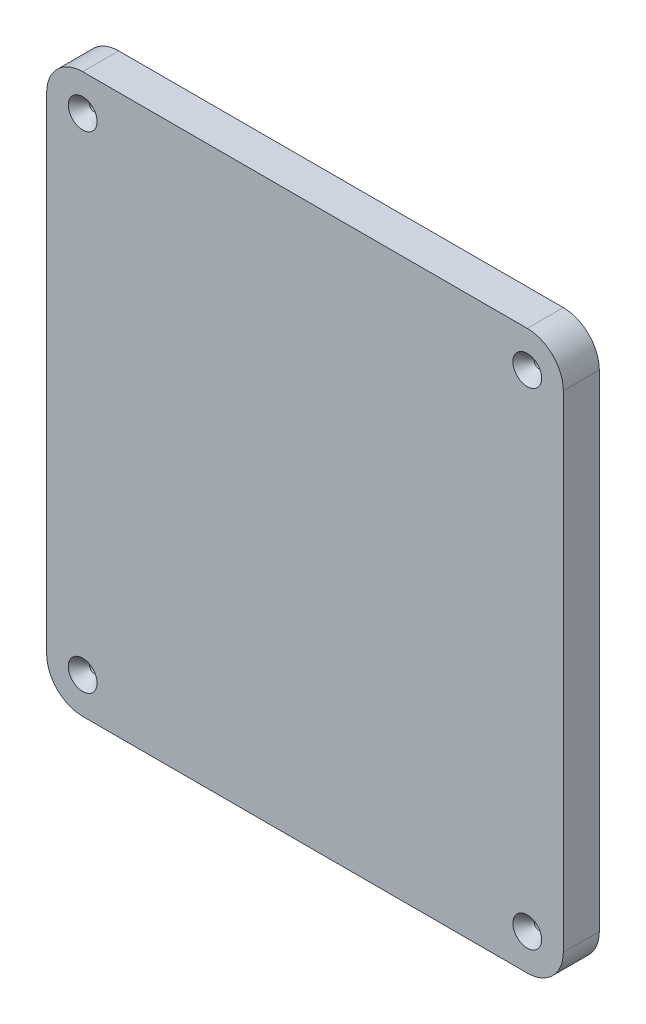
ISO-10303-21;
HEADER;
FILE_DESCRIPTION(('STEP AP214'),'2;1');
FILE_NAME('part.step','',(''),(''),'','','');
FILE_SCHEMA(('AUTOMOTIVE_DESIGN { 1 0 10303 214 1 1 1 1 }'));
ENDSEC;
DATA;
#1=APPLICATION_CONTEXT('core data for automotive mechanical design processes');
#2=APPLICATION_PROTOCOL_DEFINITION('international standard','automotive_design',2000,#1);
#3=PRODUCT_CONTEXT('',#1,'mechanical');
#4=PRODUCT('Part','Part','',(#3));
#5=PRODUCT_RELATED_PRODUCT_CATEGORY('part','',(#4));
#6=PRODUCT_DEFINITION_FORMATION('','',#4);
#7=PRODUCT_DEFINITION_CONTEXT('part definition',#1,'design');
#8=PRODUCT_DEFINITION('design','',#6,#7);
#9=PRODUCT_DEFINITION_SHAPE('','',#8);
#10=(LENGTH_UNIT() NAMED_UNIT(*) SI_UNIT(.MILLI.,.METRE.));
#11=(NAMED_UNIT(*) PLANE_ANGLE_UNIT() SI_UNIT($,.RADIAN.));
#12=(NAMED_UNIT(*) SI_UNIT($,.STERADIAN.) SOLID_ANGLE_UNIT());
#13=UNCERTAINTY_MEASURE_WITH_UNIT(LENGTH_MEASURE(1.E-05),#10,'distance_accuracy_value','');
#14=(GEOMETRIC_REPRESENTATION_CONTEXT(3) GLOBAL_UNCERTAINTY_ASSIGNED_CONTEXT((#13)) GLOBAL_UNIT_ASSIGNED_CONTEXT((#10,
#11,#12)) REPRESENTATION_CONTEXT('',''));
#15=CARTESIAN_POINT('',(0.,0.,0.));
#16=DIRECTION('',(0.,0.,1.));
#17=DIRECTION('',(1.,0.,0.));
#18=AXIS2_PLACEMENT_3D('',#15,#16,#17);
#19=CARTESIAN_POINT('',(-43.0999999939929,668.077163009694,12.7000000000008));
#20=DIRECTION('',(0.,0.999999999999997,0.));
#21=DIRECTION('',(-1.,0.,0.));
#22=AXIS2_PLACEMENT_3D('',#19,#20,#21);
#23=PLANE('',#22);
#24=DIRECTION('',(1.,0.,0.));
#25=VECTOR('',#24,1.);
#26=CARTESIAN_POINT('',(-43.0999999939928,668.077163009697,6.66133814775094E-13));
#27=LINE('',#26,#25);
#28=CARTESIAN_POINT('',(-30.399999993993,668.077163009697,6.66133814775094E-13));
#29=VERTEX_POINT('',#28);
#30=CARTESIAN_POINT('',(126.350000000009,668.077163009695,1.33226762955019E-12));
#31=VERTEX_POINT('',#30);
#32=EDGE_CURVE('E138',#29,#31,#27,.T.);
#33=ORIENTED_EDGE('',*,*,#32,.T.);
#34=DIRECTION('',(0.,0.,-0.999999999999997));
#35=VECTOR('',#34,1.);
#36=CARTESIAN_POINT('',(126.350000000009,668.077163009695,12.7000000000015));
#37=LINE('',#36,#35);
#38=CARTESIAN_POINT('',(126.350000000009,668.077163009695,12.7000000000015));
#39=VERTEX_POINT('',#38);
#40=EDGE_CURVE('E161',#31,#39,#37,.F.);
#41=ORIENTED_EDGE('',*,*,#40,.T.);
#42=DIRECTION('',(1.,0.,0.));
#43=VECTOR('',#42,1.);
#44=CARTESIAN_POINT('',(-43.0999999939929,668.077163009694,12.7000000000008));
#45=LINE('',#44,#43);
#46=CARTESIAN_POINT('',(-30.3999999939932,668.077163009697,12.7000000000008));
#47=VERTEX_POINT('',#46);
#48=EDGE_CURVE('E136',#47,#39,#45,.T.);
#49=ORIENTED_EDGE('',*,*,#48,.F.);
#50=DIRECTION('',(0.,0.,-0.999999999999997));
#51=VECTOR('',#50,1.);
#52=CARTESIAN_POINT('',(-30.3999999939932,668.077163009697,12.7000000000008));
#53=LINE('',#52,#51);
#54=EDGE_CURVE('E158',#47,#29,#53,.T.);
#55=ORIENTED_EDGE('',*,*,#54,.T.);
#56=EDGE_LOOP('',(#33,#41,#49,#55));
#57=FACE_BOUND('',#56,.T.);
#58=ADVANCED_FACE('F41',(#57),#23,.F.);
#59=CARTESIAN_POINT('',(139.050000000009,668.077163009695,12.7000000000015));
#60=DIRECTION('',(-1.,0.,0.));
#61=DIRECTION('',(0.,-0.999999999999997,0.));
#62=AXIS2_PLACEMENT_3D('',#59,#60,#61);
#63=PLANE('',#62);
#64=DIRECTION('',(0.,0.999999999999997,0.));
#65=VECTOR('',#64,1.);
#66=CARTESIAN_POINT('',(139.050000000009,668.077163009695,1.55431223447522E-12));
#67=LINE('',#66,#65);
#68=CARTESIAN_POINT('',(139.050000000009,680.777163009695,1.33226762955019E-12));
#69=VERTEX_POINT('',#68);
#70=CARTESIAN_POINT('',(139.050000000008,852.227163009694,6.66133814775094E-13));
#71=VERTEX_POINT('',#70);
#72=EDGE_CURVE('E134',#69,#71,#67,.T.);
#73=ORIENTED_EDGE('',*,*,#72,.T.);
#74=DIRECTION('',(0.,0.,-0.999999999999997));
#75=VECTOR('',#74,1.);
#76=CARTESIAN_POINT('',(139.050000000009,852.227163009694,12.7000000000004));
#77=LINE('',#76,#75);
#78=CARTESIAN_POINT('',(139.050000000009,852.227163009694,12.7000000000004));
#79=VERTEX_POINT('',#78);
#80=EDGE_CURVE('E113',#71,#79,#77,.F.);
#81=ORIENTED_EDGE('',*,*,#80,.T.);
#82=DIRECTION('',(0.,0.999999999999997,0.));
#83=VECTOR('',#82,1.);
#84=CARTESIAN_POINT('',(139.050000000009,668.077163009695,12.7000000000015));
#85=LINE('',#84,#83);
#86=CARTESIAN_POINT('',(139.050000000009,680.777163009694,12.7000000000017));
#87=VERTEX_POINT('',#86);
#88=EDGE_CURVE('E198',#87,#79,#85,.T.);
#89=ORIENTED_EDGE('',*,*,#88,.F.);
#90=DIRECTION('',(0.,0.,-0.999999999999997));
#91=VECTOR('',#90,1.);
#92=CARTESIAN_POINT('',(139.050000000009,680.777163009694,12.7000000000017));
#93=LINE('',#92,#91);
#94=EDGE_CURVE('E118',#87,#69,#93,.T.);
#95=ORIENTED_EDGE('',*,*,#94,.T.);
#96=EDGE_LOOP('',(#73,#81,#89,#95));
#97=FACE_BOUND('',#96,.T.);
#98=ADVANCED_FACE('F215',(#97),#63,.F.);
#99=CARTESIAN_POINT('',(139.050000000009,864.927163009692,12.7000000000015));
#100=DIRECTION('',(0.,-0.999999999999997,0.));
#101=DIRECTION('',(1.,0.,0.));
#102=AXIS2_PLACEMENT_3D('',#99,#100,#101);
#103=PLANE('',#102);
#104=DIRECTION('',(-1.,0.,0.));
#105=VECTOR('',#104,1.);
#106=CARTESIAN_POINT('',(139.050000000009,864.927163009692,12.7000000000015));
#107=LINE('',#106,#105);
#108=CARTESIAN_POINT('',(126.350000000009,864.927163009694,12.7000000000013));
#109=VERTEX_POINT('',#108);
#110=CARTESIAN_POINT('',(-30.3999999939929,864.927163009694,12.700000000002));
#111=VERTEX_POINT('',#110);
#112=EDGE_CURVE('E127',#109,#111,#107,.T.);
#113=ORIENTED_EDGE('',*,*,#112,.F.);
#114=DIRECTION('',(0.,0.,-0.999999999999997));
#115=VECTOR('',#114,1.);
#116=CARTESIAN_POINT('',(126.350000000009,864.927163009694,12.7000000000013));
#117=LINE('',#116,#115);
#118=CARTESIAN_POINT('',(126.350000000009,864.927163009693,1.88737914186277E-12));
#119=VERTEX_POINT('',#118);
#120=EDGE_CURVE('E112',#109,#119,#117,.T.);
#121=ORIENTED_EDGE('',*,*,#120,.T.);
#122=DIRECTION('',(-1.,0.,0.));
#123=VECTOR('',#122,1.);
#124=CARTESIAN_POINT('',(139.050000000009,864.927163009694,8.88178419700125E-13));
#125=LINE('',#124,#123);
#126=CARTESIAN_POINT('',(-30.3999999939926,864.927163009693,2.22044604925031E-12));
#127=VERTEX_POINT('',#126);
#128=EDGE_CURVE('E125',#119,#127,#125,.T.);
#129=ORIENTED_EDGE('',*,*,#128,.T.);
#130=DIRECTION('',(0.,0.,-0.999999999999997));
#131=VECTOR('',#130,1.);
#132=CARTESIAN_POINT('',(-30.3999999939929,864.927163009694,12.700000000002));
#133=LINE('',#132,#131);
#134=EDGE_CURVE('E129',#127,#111,#133,.F.);
#135=ORIENTED_EDGE('',*,*,#134,.T.);
#136=EDGE_LOOP('',(#113,#121,#129,#135));
#137=FACE_BOUND('',#136,.T.);
#138=ADVANCED_FACE('F124',(#137),#103,.F.);
#139=CARTESIAN_POINT('',(-43.099999993993,864.927163009693,12.7000000000016));
#140=DIRECTION('',(1.,0.,0.));
#141=DIRECTION('',(0.,0.999999999999997,0.));
#142=AXIS2_PLACEMENT_3D('',#139,#140,#141);
#143=PLANE('',#142);
#144=DIRECTION('',(0.,-0.999999999999997,0.));
#145=VECTOR('',#144,1.);
#146=CARTESIAN_POINT('',(-43.0999999939928,864.927163009694,1.55431223447522E-12));
#147=LINE('',#146,#145);
#148=CARTESIAN_POINT('',(-43.099999993993,852.227163009693,6.66133814775094E-13));
#149=VERTEX_POINT('',#148);
#150=CARTESIAN_POINT('',(-43.0999999939931,680.777163009694,7.7715611723761E-13));
#151=VERTEX_POINT('',#150);
#152=EDGE_CURVE('E133',#149,#151,#147,.T.);
#153=ORIENTED_EDGE('',*,*,#152,.T.);
#154=DIRECTION('',(0.,0.,-0.999999999999997));
#155=VECTOR('',#154,1.);
#156=CARTESIAN_POINT('',(-43.099999993993,680.777163009696,12.7000000000002));
#157=LINE('',#156,#155);
#158=CARTESIAN_POINT('',(-43.099999993993,680.777163009696,12.7000000000002));
#159=VERTEX_POINT('',#158);
#160=EDGE_CURVE('E11',#151,#159,#157,.F.);
#161=ORIENTED_EDGE('',*,*,#160,.T.);
#162=DIRECTION('',(0.,-0.999999999999997,0.));
#163=VECTOR('',#162,1.);
#164=CARTESIAN_POINT('',(-43.099999993993,864.927163009693,12.7000000000016));
#165=LINE('',#164,#163);
#166=CARTESIAN_POINT('',(-43.099999993993,852.227163009695,12.700000000001));
#167=VERTEX_POINT('',#166);
#168=EDGE_CURVE('E142',#167,#159,#165,.T.);
#169=ORIENTED_EDGE('',*,*,#168,.F.);
#170=DIRECTION('',(0.,0.,-0.999999999999997));
#171=VECTOR('',#170,1.);
#172=CARTESIAN_POINT('',(-43.099999993993,852.227163009695,12.700000000001));
#173=LINE('',#172,#171);
#174=EDGE_CURVE('E50',#167,#149,#173,.T.);
#175=ORIENTED_EDGE('',*,*,#174,.T.);
#176=EDGE_LOOP('',(#153,#161,#169,#175));
#177=FACE_BOUND('',#176,.T.);
#178=ADVANCED_FACE('F222',(#177),#143,.F.);
#179=CARTESIAN_POINT('',(1.31838984174237E-13,0.,12.7000000000018));
#180=DIRECTION('',(0.,0.,0.999999999999997));
#181=DIRECTION('',(1.,0.,0.));
#182=AXIS2_PLACEMENT_3D('',#179,#180,#181);
#183=PLANE('',#182);
#184=CARTESIAN_POINT('',(-30.3999999939931,852.227163009694,12.7000000000019));
#185=DIRECTION('',(0.,0.,0.999999999999997));
#186=DIRECTION('',(1.,0.,0.));
#187=AXIS2_PLACEMENT_3D('',#184,#185,#186);
#188=CIRCLE('',#187,5.08);
#189=CARTESIAN_POINT('',(-25.3199999939931,852.227163009694,12.7000000000019));
#190=VERTEX_POINT('',#189);
#191=EDGE_CURVE('E287',#190,#190,#188,.T.);
#192=ORIENTED_EDGE('',*,*,#191,.F.);
#193=EDGE_LOOP('',(#192));
#194=FACE_BOUND('',#193,.T.);
#195=CARTESIAN_POINT('',(-30.399999993993,680.777163009697,12.700000000001));
#196=DIRECTION('',(0.,0.,0.999999999999997));
#197=DIRECTION('',(1.,0.,0.));
#198=AXIS2_PLACEMENT_3D('',#195,#196,#197);
#199=CIRCLE('',#198,5.08);
#200=CARTESIAN_POINT('',(-25.319999993993,680.777163009697,12.700000000001));
#201=VERTEX_POINT('',#200);
#202=EDGE_CURVE('E182',#201,#201,#199,.T.);
#203=ORIENTED_EDGE('',*,*,#202,.F.);
#204=EDGE_LOOP('',(#203));
#205=FACE_BOUND('',#204,.T.);
#206=CARTESIAN_POINT('',(126.350000000009,680.777163009694,12.7000000000017));
#207=DIRECTION('',(0.,0.,0.999999999999997));
#208=DIRECTION('',(1.,0.,0.));
#209=AXIS2_PLACEMENT_3D('',#206,#207,#208);
#210=CIRCLE('',#209,5.08);
#211=CARTESIAN_POINT('',(131.430000000009,680.777163009694,12.7000000000017));
#212=VERTEX_POINT('',#211);
#213=EDGE_CURVE('E175',#212,#212,#210,.T.);
#214=ORIENTED_EDGE('',*,*,#213,.F.);
#215=EDGE_LOOP('',(#214));
#216=FACE_BOUND('',#215,.T.);
#217=CARTESIAN_POINT('',(126.350000000009,852.227163009692,12.7000000000017));
#218=DIRECTION('',(0.,0.,0.999999999999997));
#219=DIRECTION('',(1.,0.,0.));
#220=AXIS2_PLACEMENT_3D('',#217,#218,#219);
#221=CIRCLE('',#220,5.08);
#222=CARTESIAN_POINT('',(131.430000000009,852.227163009692,12.7000000000017));
#223=VERTEX_POINT('',#222);
#224=EDGE_CURVE('E171',#223,#223,#221,.T.);
#225=ORIENTED_EDGE('',*,*,#224,.F.);
#226=EDGE_LOOP('',(#225));
#227=FACE_BOUND('',#226,.T.);
#228=ORIENTED_EDGE('',*,*,#88,.T.);
#229=CARTESIAN_POINT('',(126.350000000009,852.227163009694,12.7000000000004));
#230=DIRECTION('',(0.,0.,0.999999999999997));
#231=DIRECTION('',(1.,0.,0.));
#232=AXIS2_PLACEMENT_3D('',#229,#230,#231);
#233=CIRCLE('',#232,12.7);
#234=EDGE_CURVE('E156',#79,#109,#233,.T.);
#235=ORIENTED_EDGE('',*,*,#234,.T.);
#236=ORIENTED_EDGE('',*,*,#112,.T.);
#237=CARTESIAN_POINT('',(-30.3999999939931,852.227163009694,12.7000000000019));
#238=DIRECTION('',(0.,0.,0.999999999999997));
#239=DIRECTION('',(1.,0.,0.));
#240=AXIS2_PLACEMENT_3D('',#237,#238,#239);
#241=CIRCLE('',#240,12.7);
#242=EDGE_CURVE('E63',#111,#167,#241,.T.);
#243=ORIENTED_EDGE('',*,*,#242,.T.);
#244=ORIENTED_EDGE('',*,*,#168,.T.);
#245=CARTESIAN_POINT('',(-30.399999993993,680.777163009695,12.7000000000017));
#246=DIRECTION('',(0.,0.,0.999999999999997));
#247=DIRECTION('',(1.,0.,0.));
#248=AXIS2_PLACEMENT_3D('',#245,#246,#247);
#249=CIRCLE('',#248,12.7);
#250=EDGE_CURVE('E152',#159,#47,#249,.T.);
#251=ORIENTED_EDGE('',*,*,#250,.T.);
#252=ORIENTED_EDGE('',*,*,#48,.T.);
#253=CARTESIAN_POINT('',(126.350000000009,680.777163009694,12.7000000000017));
#254=DIRECTION('',(0.,0.,0.999999999999997));
#255=DIRECTION('',(1.,0.,0.));
#256=AXIS2_PLACEMENT_3D('',#253,#254,#255);
#257=CIRCLE('',#256,12.7);
#258=EDGE_CURVE('E154',#39,#87,#257,.T.);
#259=ORIENTED_EDGE('',*,*,#258,.T.);
#260=EDGE_LOOP('',(#228,#235,#236,#243,#244,#251,#252,#259));
#261=FACE_BOUND('',#260,.T.);
#262=ADVANCED_FACE('F213',(#194,#205,#216,#227,#261),#183,.T.);
#263=CARTESIAN_POINT('',(0.,0.,0.));
#264=DIRECTION('',(0.,0.,0.999999999999997));
#265=DIRECTION('',(1.,0.,0.));
#266=AXIS2_PLACEMENT_3D('',#263,#264,#265);
#267=PLANE('',#266);
#268=CARTESIAN_POINT('',(-30.399999993993,852.227163009695,1.55431223447522E-12));
#269=DIRECTION('',(0.,0.,0.999999999999997));
#270=DIRECTION('',(1.,0.,0.));
#271=AXIS2_PLACEMENT_3D('',#268,#269,#270);
#272=CIRCLE('',#271,1.5875);
#273=CARTESIAN_POINT('',(-28.812499993993,852.227163009695,1.55431223447522E-12));
#274=VERTEX_POINT('',#273);
#275=EDGE_CURVE('E45',#274,#274,#272,.T.);
#276=ORIENTED_EDGE('',*,*,#275,.T.);
#277=EDGE_LOOP('',(#276));
#278=FACE_BOUND('',#277,.T.);
#279=CARTESIAN_POINT('',(-30.3999999939931,680.777163009696,1.33226762955019E-12));
#280=DIRECTION('',(0.,0.,0.999999999999997));
#281=DIRECTION('',(1.,0.,0.));
#282=AXIS2_PLACEMENT_3D('',#279,#280,#281);
#283=CIRCLE('',#282,1.5875);
#284=CARTESIAN_POINT('',(-28.8124999939931,680.777163009696,1.33226762955019E-12));
#285=VERTEX_POINT('',#284);
#286=EDGE_CURVE('E173',#285,#285,#283,.T.);
#287=ORIENTED_EDGE('',*,*,#286,.T.);
#288=EDGE_LOOP('',(#287));
#289=FACE_BOUND('',#288,.T.);
#290=CARTESIAN_POINT('',(126.350000000009,680.777163009695,1.33226762955019E-12));
#291=DIRECTION('',(0.,0.,0.999999999999997));
#292=DIRECTION('',(1.,0.,0.));
#293=AXIS2_PLACEMENT_3D('',#290,#291,#292);
#294=CIRCLE('',#293,1.58750000000001);
#295=CARTESIAN_POINT('',(127.937500000009,680.777163009695,1.33226762955019E-12));
#296=VERTEX_POINT('',#295);
#297=EDGE_CURVE('E169',#296,#296,#294,.T.);
#298=ORIENTED_EDGE('',*,*,#297,.T.);
#299=EDGE_LOOP('',(#298));
#300=FACE_BOUND('',#299,.T.);
#301=CARTESIAN_POINT('',(126.350000000008,852.227163009694,6.66133814775094E-13));
#302=DIRECTION('',(0.,0.,0.999999999999997));
#303=DIRECTION('',(1.,0.,0.));
#304=AXIS2_PLACEMENT_3D('',#301,#302,#303);
#305=CIRCLE('',#304,1.58749999999999);
#306=CARTESIAN_POINT('',(127.937500000008,852.227163009694,6.66133814775094E-13));
#307=VERTEX_POINT('',#306);
#308=EDGE_CURVE('E165',#307,#307,#305,.T.);
#309=ORIENTED_EDGE('',*,*,#308,.T.);
#310=EDGE_LOOP('',(#309));
#311=FACE_BOUND('',#310,.T.);
#312=ORIENTED_EDGE('',*,*,#128,.F.);
#313=CARTESIAN_POINT('',(126.350000000008,852.227163009694,6.66133814775094E-13));
#314=DIRECTION('',(0.,0.,0.999999999999997));
#315=DIRECTION('',(1.,0.,0.));
#316=AXIS2_PLACEMENT_3D('',#313,#314,#315);
#317=CIRCLE('',#316,12.7);
#318=EDGE_CURVE('E108',#119,#71,#317,.F.);
#319=ORIENTED_EDGE('',*,*,#318,.T.);
#320=ORIENTED_EDGE('',*,*,#72,.F.);
#321=CARTESIAN_POINT('',(126.350000000009,680.777163009695,1.33226762955019E-12));
#322=DIRECTION('',(0.,0.,0.999999999999997));
#323=DIRECTION('',(1.,0.,0.));
#324=AXIS2_PLACEMENT_3D('',#321,#322,#323);
#325=CIRCLE('',#324,12.7);
#326=EDGE_CURVE('E119',#69,#31,#325,.F.);
#327=ORIENTED_EDGE('',*,*,#326,.T.);
#328=ORIENTED_EDGE('',*,*,#32,.F.);
#329=CARTESIAN_POINT('',(-30.3999999939931,680.777163009696,1.33226762955019E-12));
#330=DIRECTION('',(0.,0.,0.999999999999997));
#331=DIRECTION('',(1.,0.,0.));
#332=AXIS2_PLACEMENT_3D('',#329,#330,#331);
#333=CIRCLE('',#332,12.7);
#334=EDGE_CURVE('E145',#29,#151,#333,.F.);
#335=ORIENTED_EDGE('',*,*,#334,.T.);
#336=ORIENTED_EDGE('',*,*,#152,.F.);
#337=CARTESIAN_POINT('',(-30.399999993993,852.227163009695,1.55431223447522E-12));
#338=DIRECTION('',(0.,0.,0.999999999999997));
#339=DIRECTION('',(1.,0.,0.));
#340=AXIS2_PLACEMENT_3D('',#337,#338,#339);
#341=CIRCLE('',#340,12.7);
#342=EDGE_CURVE('E128',#149,#127,#341,.F.);
#343=ORIENTED_EDGE('',*,*,#342,.T.);
#344=EDGE_LOOP('',(#312,#319,#320,#327,#328,#335,#336,#343));
#345=FACE_BOUND('',#344,.T.);
#346=ADVANCED_FACE('F131',(#278,#289,#300,#311,#345),#267,.F.);
#347=CARTESIAN_POINT('',(126.350000000009,852.227163009694,12.7000000000004));
#348=DIRECTION('',(0.,0.,-0.999999999999997));
#349=DIRECTION('',(-1.,0.,0.));
#350=AXIS2_PLACEMENT_3D('',#347,#348,#349);
#351=CYLINDRICAL_SURFACE('',#350,12.7);
#352=ORIENTED_EDGE('',*,*,#234,.F.);
#353=ORIENTED_EDGE('',*,*,#80,.F.);
#354=ORIENTED_EDGE('',*,*,#318,.F.);
#355=ORIENTED_EDGE('',*,*,#120,.F.);
#356=EDGE_LOOP('',(#352,#353,#354,#355));
#357=FACE_BOUND('',#356,.T.);
#358=ADVANCED_FACE('F111',(#357),#351,.T.);
#359=CARTESIAN_POINT('',(126.350000000009,680.777163009694,12.7000000000017));
#360=DIRECTION('',(0.,0.,-0.999999999999997));
#361=DIRECTION('',(-1.,0.,0.));
#362=AXIS2_PLACEMENT_3D('',#359,#360,#361);
#363=CYLINDRICAL_SURFACE('',#362,12.7);
#364=ORIENTED_EDGE('',*,*,#258,.F.);
#365=ORIENTED_EDGE('',*,*,#40,.F.);
#366=ORIENTED_EDGE('',*,*,#326,.F.);
#367=ORIENTED_EDGE('',*,*,#94,.F.);
#368=EDGE_LOOP('',(#364,#365,#366,#367));
#369=FACE_BOUND('',#368,.T.);
#370=ADVANCED_FACE('F210',(#369),#363,.T.);
#371=CARTESIAN_POINT('',(-30.399999993993,680.777163009695,12.7000000000017));
#372=DIRECTION('',(0.,0.,-0.999999999999997));
#373=DIRECTION('',(-1.,0.,0.));
#374=AXIS2_PLACEMENT_3D('',#371,#372,#373);
#375=CYLINDRICAL_SURFACE('',#374,12.7);
#376=ORIENTED_EDGE('',*,*,#250,.F.);
#377=ORIENTED_EDGE('',*,*,#160,.F.);
#378=ORIENTED_EDGE('',*,*,#334,.F.);
#379=ORIENTED_EDGE('',*,*,#54,.F.);
#380=EDGE_LOOP('',(#376,#377,#378,#379));
#381=FACE_BOUND('',#380,.T.);
#382=ADVANCED_FACE('F230',(#381),#375,.T.);
#383=CARTESIAN_POINT('',(-30.3999999939931,852.227163009694,12.7000000000019));
#384=DIRECTION('',(0.,0.,-0.999999999999997));
#385=DIRECTION('',(-1.,0.,0.));
#386=AXIS2_PLACEMENT_3D('',#383,#384,#385);
#387=CYLINDRICAL_SURFACE('',#386,12.7);
#388=ORIENTED_EDGE('',*,*,#242,.F.);
#389=ORIENTED_EDGE('',*,*,#134,.F.);
#390=ORIENTED_EDGE('',*,*,#342,.F.);
#391=ORIENTED_EDGE('',*,*,#174,.F.);
#392=EDGE_LOOP('',(#388,#389,#390,#391));
#393=FACE_BOUND('',#392,.T.);
#394=ADVANCED_FACE('F43',(#393),#387,.T.);
#395=CARTESIAN_POINT('',(126.350000000009,852.227163009692,12.7000000000017));
#396=DIRECTION('',(0.,0.,0.999999999999997));
#397=DIRECTION('',(1.,0.,0.));
#398=AXIS2_PLACEMENT_3D('',#395,#396,#397);
#399=CYLINDRICAL_SURFACE('',#398,1.58749999999999);
#400=CARTESIAN_POINT('',(126.350000000009,852.227163009694,8.68233833778231));
#401=DIRECTION('',(0.,0.,0.999999999999997));
#402=DIRECTION('',(1.,0.,0.));
#403=AXIS2_PLACEMENT_3D('',#400,#401,#402);
#404=CIRCLE('',#403,1.58749999999999);
#405=CARTESIAN_POINT('',(127.937500000009,852.227163009694,8.68233833778231));
#406=VERTEX_POINT('',#405);
#407=EDGE_CURVE('E168',#406,#406,#404,.T.);
#408=ORIENTED_EDGE('',*,*,#407,.T.);
#409=EDGE_LOOP('',(#408));
#410=FACE_BOUND('',#409,.T.);
#411=ORIENTED_EDGE('',*,*,#308,.F.);
#412=EDGE_LOOP('',(#411));
#413=FACE_BOUND('',#412,.T.);
#414=ADVANCED_FACE('F236',(#410,#413),#399,.F.);
#415=CARTESIAN_POINT('',(126.350000000009,852.227163009692,12.7000000000017));
#416=DIRECTION('',(0.,0.,0.999999999999997));
#417=DIRECTION('',(1.,0.,0.));
#418=AXIS2_PLACEMENT_3D('',#415,#416,#417);
#419=CONICAL_SURFACE('',#418,5.08,0.715584993317678);
#420=ORIENTED_EDGE('',*,*,#407,.F.);
#421=EDGE_LOOP('',(#420));
#422=FACE_BOUND('',#421,.T.);
#423=ORIENTED_EDGE('',*,*,#224,.T.);
#424=EDGE_LOOP('',(#423));
#425=FACE_BOUND('',#424,.T.);
#426=ADVANCED_FACE('F252',(#422,#425),#419,.F.);
#427=CARTESIAN_POINT('',(126.350000000009,680.777163009694,12.7000000000017));
#428=DIRECTION('',(0.,0.,0.999999999999997));
#429=DIRECTION('',(1.,0.,0.));
#430=AXIS2_PLACEMENT_3D('',#427,#428,#429);
#431=CYLINDRICAL_SURFACE('',#430,1.58750000000001);
#432=CARTESIAN_POINT('',(126.350000000009,680.777163009694,8.68233833778243));
#433=DIRECTION('',(0.,0.,0.999999999999997));
#434=DIRECTION('',(1.,0.,0.));
#435=AXIS2_PLACEMENT_3D('',#432,#433,#434);
#436=CIRCLE('',#435,1.58750000000002);
#437=CARTESIAN_POINT('',(127.937500000009,680.777163009694,8.68233833778243));
#438=VERTEX_POINT('',#437);
#439=EDGE_CURVE('E172',#438,#438,#436,.T.);
#440=ORIENTED_EDGE('',*,*,#439,.T.);
#441=EDGE_LOOP('',(#440));
#442=FACE_BOUND('',#441,.T.);
#443=ORIENTED_EDGE('',*,*,#297,.F.);
#444=EDGE_LOOP('',(#443));
#445=FACE_BOUND('',#444,.T.);
#446=ADVANCED_FACE('F256',(#442,#445),#431,.F.);
#447=CARTESIAN_POINT('',(126.350000000009,680.777163009694,12.7000000000017));
#448=DIRECTION('',(0.,0.,0.999999999999997));
#449=DIRECTION('',(1.,0.,0.));
#450=AXIS2_PLACEMENT_3D('',#447,#448,#449);
#451=CONICAL_SURFACE('',#450,5.08,0.715584993317674);
#452=ORIENTED_EDGE('',*,*,#439,.F.);
#453=EDGE_LOOP('',(#452));
#454=FACE_BOUND('',#453,.T.);
#455=ORIENTED_EDGE('',*,*,#213,.T.);
#456=EDGE_LOOP('',(#455));
#457=FACE_BOUND('',#456,.T.);
#458=ADVANCED_FACE('F260',(#454,#457),#451,.F.);
#459=CARTESIAN_POINT('',(-30.399999993993,680.777163009697,12.700000000001));
#460=DIRECTION('',(0.,0.,0.999999999999997));
#461=DIRECTION('',(1.,0.,0.));
#462=AXIS2_PLACEMENT_3D('',#459,#460,#461);
#463=CYLINDRICAL_SURFACE('',#462,1.5875);
#464=CARTESIAN_POINT('',(-30.3999999939933,680.777163009697,8.68233833778209));
#465=DIRECTION('',(0.,0.,0.999999999999997));
#466=DIRECTION('',(1.,0.,0.));
#467=AXIS2_PLACEMENT_3D('',#464,#465,#466);
#468=CIRCLE('',#467,1.58750000000001);
#469=CARTESIAN_POINT('',(-28.8124999939932,680.777163009697,8.68233833778209));
#470=VERTEX_POINT('',#469);
#471=EDGE_CURVE('E176',#470,#470,#468,.T.);
#472=ORIENTED_EDGE('',*,*,#471,.T.);
#473=EDGE_LOOP('',(#472));
#474=FACE_BOUND('',#473,.T.);
#475=ORIENTED_EDGE('',*,*,#286,.F.);
#476=EDGE_LOOP('',(#475));
#477=FACE_BOUND('',#476,.T.);
#478=ADVANCED_FACE('F264',(#474,#477),#463,.F.);
#479=CARTESIAN_POINT('',(-30.399999993993,680.777163009697,12.700000000001));
#480=DIRECTION('',(0.,0.,0.999999999999997));
#481=DIRECTION('',(1.,0.,0.));
#482=AXIS2_PLACEMENT_3D('',#479,#480,#481);
#483=CONICAL_SURFACE('',#482,5.08,0.715584993317676);
#484=ORIENTED_EDGE('',*,*,#471,.F.);
#485=EDGE_LOOP('',(#484));
#486=FACE_BOUND('',#485,.T.);
#487=ORIENTED_EDGE('',*,*,#202,.T.);
#488=EDGE_LOOP('',(#487));
#489=FACE_BOUND('',#488,.T.);
#490=ADVANCED_FACE('F268',(#486,#489),#483,.F.);
#491=CARTESIAN_POINT('',(-30.3999999939931,852.227163009694,12.7000000000019));
#492=DIRECTION('',(0.,0.,0.999999999999997));
#493=DIRECTION('',(1.,0.,0.));
#494=AXIS2_PLACEMENT_3D('',#491,#492,#493);
#495=CYLINDRICAL_SURFACE('',#494,1.5875);
#496=CARTESIAN_POINT('',(-30.3999999939931,852.227163009696,8.68233833778243));
#497=DIRECTION('',(0.,0.,0.999999999999997));
#498=DIRECTION('',(1.,0.,0.));
#499=AXIS2_PLACEMENT_3D('',#496,#497,#498);
#500=CIRCLE('',#499,1.58750000000001);
#501=CARTESIAN_POINT('',(-28.8124999939931,852.227163009696,8.68233833778243));
#502=VERTEX_POINT('',#501);
#503=EDGE_CURVE('E284',#502,#502,#500,.T.);
#504=ORIENTED_EDGE('',*,*,#503,.T.);
#505=EDGE_LOOP('',(#504));
#506=FACE_BOUND('',#505,.T.);
#507=ORIENTED_EDGE('',*,*,#275,.F.);
#508=EDGE_LOOP('',(#507));
#509=FACE_BOUND('',#508,.T.);
#510=ADVANCED_FACE('F271',(#506,#509),#495,.F.);
#511=CARTESIAN_POINT('',(-30.3999999939931,852.227163009694,12.7000000000019));
#512=DIRECTION('',(0.,0.,0.999999999999997));
#513=DIRECTION('',(1.,0.,0.));
#514=AXIS2_PLACEMENT_3D('',#511,#512,#513);
#515=CONICAL_SURFACE('',#514,5.08,0.715584993317676);
#516=ORIENTED_EDGE('',*,*,#503,.F.);
#517=EDGE_LOOP('',(#516));
#518=FACE_BOUND('',#517,.T.);
#519=ORIENTED_EDGE('',*,*,#191,.T.);
#520=EDGE_LOOP('',(#519));
#521=FACE_BOUND('',#520,.T.);
#522=ADVANCED_FACE('F275',(#518,#521),#515,.F.);
#523=CLOSED_SHELL('',(#58,#98,#138,#178,#262,#346,#358,#370,#382,#394,#414,#426,#446,#458,#478,
#490,#510,#522));
#524=MANIFOLD_SOLID_BREP('B2',#523);
#525=ADVANCED_BREP_SHAPE_REPRESENTATION('',(#18,#524),#14);
#526=SHAPE_DEFINITION_REPRESENTATION(#9,#525);
ENDSEC;
END-ISO-10303-21;
